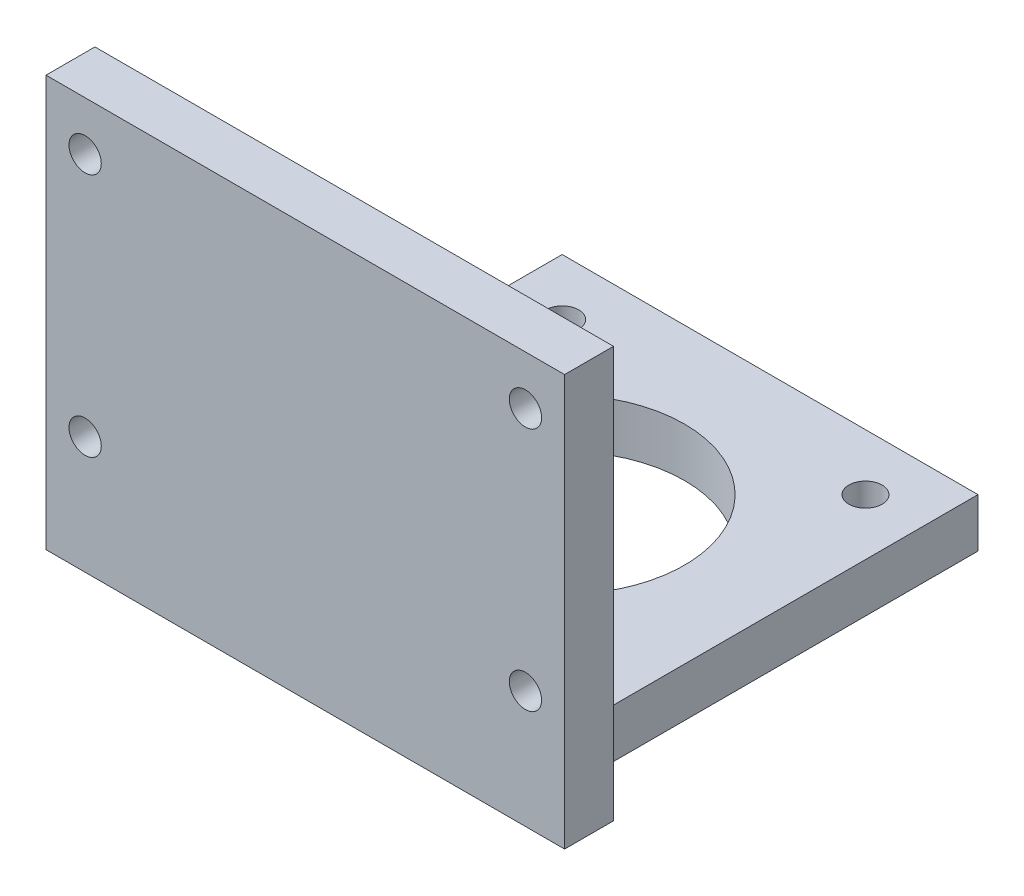
ISO-10303-21;
HEADER;
FILE_DESCRIPTION(('STEP AP214'),'2;1');
FILE_NAME('part.step','',(''),(''),'','','');
FILE_SCHEMA(('AUTOMOTIVE_DESIGN { 1 0 10303 214 1 1 1 1 }'));
ENDSEC;
DATA;
#1=APPLICATION_CONTEXT('core data for automotive mechanical design processes');
#2=APPLICATION_PROTOCOL_DEFINITION('international standard','automotive_design',2000,#1);
#3=PRODUCT_CONTEXT('',#1,'mechanical');
#4=PRODUCT('Part','Part','',(#3));
#5=PRODUCT_RELATED_PRODUCT_CATEGORY('part','',(#4));
#6=PRODUCT_DEFINITION_FORMATION('','',#4);
#7=PRODUCT_DEFINITION_CONTEXT('part definition',#1,'design');
#8=PRODUCT_DEFINITION('design','',#6,#7);
#9=PRODUCT_DEFINITION_SHAPE('','',#8);
#10=(LENGTH_UNIT() NAMED_UNIT(*) SI_UNIT(.MILLI.,.METRE.));
#11=(NAMED_UNIT(*) PLANE_ANGLE_UNIT() SI_UNIT($,.RADIAN.));
#12=(NAMED_UNIT(*) SI_UNIT($,.STERADIAN.) SOLID_ANGLE_UNIT());
#13=UNCERTAINTY_MEASURE_WITH_UNIT(LENGTH_MEASURE(1.E-05),#10,'distance_accuracy_value','');
#14=(GEOMETRIC_REPRESENTATION_CONTEXT(3) GLOBAL_UNCERTAINTY_ASSIGNED_CONTEXT((#13)) GLOBAL_UNIT_ASSIGNED_CONTEXT((#10,
#11,#12)) REPRESENTATION_CONTEXT('',''));
#15=CARTESIAN_POINT('',(0.,0.,0.));
#16=DIRECTION('',(0.,0.,1.));
#17=DIRECTION('',(1.,0.,0.));
#18=AXIS2_PLACEMENT_3D('',#15,#16,#17);
#19=CARTESIAN_POINT('',(0.,5.,0.));
#20=DIRECTION('',(0.,1.,0.));
#21=DIRECTION('',(0.,0.,1.));
#22=AXIS2_PLACEMENT_3D('',#19,#20,#21);
#23=PLANE('',#22);
#24=CARTESIAN_POINT('',(15.5,5.,15.5));
#25=DIRECTION('',(0.,1.,0.));
#26=DIRECTION('',(0.,0.,1.));
#27=AXIS2_PLACEMENT_3D('',#24,#25,#26);
#28=CIRCLE('',#27,1.7);
#29=CARTESIAN_POINT('',(15.5,5.,17.2));
#30=VERTEX_POINT('',#29);
#31=EDGE_CURVE('E143',#30,#30,#28,.T.);
#32=ORIENTED_EDGE('',*,*,#31,.F.);
#33=EDGE_LOOP('',(#32));
#34=FACE_BOUND('',#33,.T.);
#35=CARTESIAN_POINT('',(15.5,5.,-15.5));
#36=DIRECTION('',(0.,1.,0.));
#37=DIRECTION('',(0.,0.,1.));
#38=AXIS2_PLACEMENT_3D('',#35,#36,#37);
#39=CIRCLE('',#38,1.7);
#40=CARTESIAN_POINT('',(15.5,5.,-13.8));
#41=VERTEX_POINT('',#40);
#42=EDGE_CURVE('E155',#41,#41,#39,.T.);
#43=ORIENTED_EDGE('',*,*,#42,.F.);
#44=EDGE_LOOP('',(#43));
#45=FACE_BOUND('',#44,.T.);
#46=DIRECTION('',(0.,0.,-1.));
#47=VECTOR('',#46,1.);
#48=CARTESIAN_POINT('',(21.25,5.,-21.25));
#49=LINE('',#48,#47);
#50=CARTESIAN_POINT('',(21.25,5.,21.25));
#51=VERTEX_POINT('',#50);
#52=CARTESIAN_POINT('',(21.25,5.,-21.25));
#53=VERTEX_POINT('',#52);
#54=EDGE_CURVE('E167',#51,#53,#49,.T.);
#55=ORIENTED_EDGE('',*,*,#54,.T.);
#56=DIRECTION('',(-1.,0.,0.));
#57=VECTOR('',#56,1.);
#58=CARTESIAN_POINT('',(-21.25,5.,-21.25));
#59=LINE('',#58,#57);
#60=CARTESIAN_POINT('',(-21.25,5.,-21.25));
#61=VERTEX_POINT('',#60);
#62=EDGE_CURVE('E75',#53,#61,#59,.T.);
#63=ORIENTED_EDGE('',*,*,#62,.T.);
#64=DIRECTION('',(0.,0.,1.));
#65=VECTOR('',#64,1.);
#66=CARTESIAN_POINT('',(-21.25,5.,-21.25));
#67=LINE('',#66,#65);
#68=CARTESIAN_POINT('',(-21.25,5.,21.25));
#69=VERTEX_POINT('',#68);
#70=EDGE_CURVE('E171',#61,#69,#67,.T.);
#71=ORIENTED_EDGE('',*,*,#70,.T.);
#72=DIRECTION('',(1.,0.,0.));
#73=VECTOR('',#72,1.);
#74=CARTESIAN_POINT('',(-21.25,5.,21.25));
#75=LINE('',#74,#73);
#76=EDGE_CURVE('E50',#69,#51,#75,.T.);
#77=ORIENTED_EDGE('',*,*,#76,.T.);
#78=EDGE_LOOP('',(#55,#63,#71,#77));
#79=FACE_BOUND('',#78,.T.);
#80=CARTESIAN_POINT('',(-15.5,5.,-15.5));
#81=DIRECTION('',(0.,1.,0.));
#82=DIRECTION('',(0.,0.,1.));
#83=AXIS2_PLACEMENT_3D('',#80,#81,#82);
#84=CIRCLE('',#83,1.7);
#85=CARTESIAN_POINT('',(-15.5,5.,-13.8));
#86=VERTEX_POINT('',#85);
#87=EDGE_CURVE('E161',#86,#86,#84,.T.);
#88=ORIENTED_EDGE('',*,*,#87,.F.);
#89=EDGE_LOOP('',(#88));
#90=FACE_BOUND('',#89,.T.);
#91=CARTESIAN_POINT('',(-15.5,5.,15.5));
#92=DIRECTION('',(0.,1.,0.));
#93=DIRECTION('',(0.,0.,1.));
#94=AXIS2_PLACEMENT_3D('',#91,#92,#93);
#95=CIRCLE('',#94,1.7);
#96=CARTESIAN_POINT('',(-15.5,5.,17.2));
#97=VERTEX_POINT('',#96);
#98=EDGE_CURVE('E149',#97,#97,#95,.T.);
#99=ORIENTED_EDGE('',*,*,#98,.F.);
#100=EDGE_LOOP('',(#99));
#101=FACE_BOUND('',#100,.T.);
#102=CARTESIAN_POINT('',(0.,5.,0.));
#103=DIRECTION('',(0.,1.,0.));
#104=DIRECTION('',(0.,0.,1.));
#105=AXIS2_PLACEMENT_3D('',#102,#103,#104);
#106=CIRCLE('',#105,12.5);
#107=CARTESIAN_POINT('',(0.,5.,12.5));
#108=VERTEX_POINT('',#107);
#109=EDGE_CURVE('E134',#108,#108,#106,.T.);
#110=ORIENTED_EDGE('',*,*,#109,.F.);
#111=EDGE_LOOP('',(#110));
#112=FACE_BOUND('',#111,.T.);
#113=ADVANCED_FACE('F33',(#34,#45,#79,#90,#101,#112),#23,.T.);
#114=CARTESIAN_POINT('',(0.,0.,0.));
#115=DIRECTION('',(0.,1.,0.));
#116=DIRECTION('',(0.,0.,1.));
#117=AXIS2_PLACEMENT_3D('',#114,#115,#116);
#118=PLANE('',#117);
#119=DIRECTION('',(0.,0.,-1.));
#120=VECTOR('',#119,1.);
#121=CARTESIAN_POINT('',(21.25,0.,-21.25));
#122=LINE('',#121,#120);
#123=CARTESIAN_POINT('',(21.25,0.,21.25));
#124=VERTEX_POINT('',#123);
#125=CARTESIAN_POINT('',(21.25,0.,-21.25));
#126=VERTEX_POINT('',#125);
#127=EDGE_CURVE('E164',#124,#126,#122,.T.);
#128=ORIENTED_EDGE('',*,*,#127,.F.);
#129=DIRECTION('',(-1.,0.,0.));
#130=VECTOR('',#129,1.);
#131=CARTESIAN_POINT('',(-26.5,0.,21.25));
#132=LINE('',#131,#130);
#133=CARTESIAN_POINT('',(26.5,0.,21.25));
#134=VERTEX_POINT('',#133);
#135=EDGE_CURVE('E193',#134,#124,#132,.T.);
#136=ORIENTED_EDGE('',*,*,#135,.F.);
#137=DIRECTION('',(0.,0.,-1.));
#138=VECTOR('',#137,1.);
#139=CARTESIAN_POINT('',(26.5,0.,21.25));
#140=LINE('',#139,#138);
#141=CARTESIAN_POINT('',(26.5,0.,26.25));
#142=VERTEX_POINT('',#141);
#143=EDGE_CURVE('E130',#142,#134,#140,.T.);
#144=ORIENTED_EDGE('',*,*,#143,.F.);
#145=DIRECTION('',(1.,0.,0.));
#146=VECTOR('',#145,1.);
#147=CARTESIAN_POINT('',(-26.5,0.,26.25));
#148=LINE('',#147,#146);
#149=CARTESIAN_POINT('',(-26.5,0.,26.25));
#150=VERTEX_POINT('',#149);
#151=EDGE_CURVE('E126',#150,#142,#148,.T.);
#152=ORIENTED_EDGE('',*,*,#151,.F.);
#153=DIRECTION('',(0.,0.,1.));
#154=VECTOR('',#153,1.);
#155=CARTESIAN_POINT('',(-26.5,0.,21.25));
#156=LINE('',#155,#154);
#157=CARTESIAN_POINT('',(-26.5,0.,21.25));
#158=VERTEX_POINT('',#157);
#159=EDGE_CURVE('E192',#158,#150,#156,.T.);
#160=ORIENTED_EDGE('',*,*,#159,.F.);
#161=CARTESIAN_POINT('',(-21.25,0.,21.25));
#162=VERTEX_POINT('',#161);
#163=EDGE_CURVE('E190',#162,#158,#132,.T.);
#164=ORIENTED_EDGE('',*,*,#163,.F.);
#165=DIRECTION('',(0.,0.,1.));
#166=VECTOR('',#165,1.);
#167=CARTESIAN_POINT('',(-21.25,0.,-21.25));
#168=LINE('',#167,#166);
#169=CARTESIAN_POINT('',(-21.25,0.,-21.25));
#170=VERTEX_POINT('',#169);
#171=EDGE_CURVE('E169',#170,#162,#168,.T.);
#172=ORIENTED_EDGE('',*,*,#171,.F.);
#173=DIRECTION('',(-1.,0.,0.));
#174=VECTOR('',#173,1.);
#175=CARTESIAN_POINT('',(-21.25,0.,-21.25));
#176=LINE('',#175,#174);
#177=EDGE_CURVE('E63',#126,#170,#176,.T.);
#178=ORIENTED_EDGE('',*,*,#177,.F.);
#179=EDGE_LOOP('',(#128,#136,#144,#152,#160,#164,#172,#178));
#180=FACE_BOUND('',#179,.T.);
#181=CARTESIAN_POINT('',(-15.5,0.,-15.5));
#182=DIRECTION('',(0.,1.,0.));
#183=DIRECTION('',(0.,0.,1.));
#184=AXIS2_PLACEMENT_3D('',#181,#182,#183);
#185=CIRCLE('',#184,1.7);
#186=CARTESIAN_POINT('',(-15.5,0.,-13.8));
#187=VERTEX_POINT('',#186);
#188=EDGE_CURVE('E158',#187,#187,#185,.T.);
#189=ORIENTED_EDGE('',*,*,#188,.T.);
#190=EDGE_LOOP('',(#189));
#191=FACE_BOUND('',#190,.T.);
#192=CARTESIAN_POINT('',(15.5,0.,-15.5));
#193=DIRECTION('',(0.,1.,0.));
#194=DIRECTION('',(0.,0.,1.));
#195=AXIS2_PLACEMENT_3D('',#192,#193,#194);
#196=CIRCLE('',#195,1.7);
#197=CARTESIAN_POINT('',(15.5,0.,-13.8));
#198=VERTEX_POINT('',#197);
#199=EDGE_CURVE('E152',#198,#198,#196,.T.);
#200=ORIENTED_EDGE('',*,*,#199,.T.);
#201=EDGE_LOOP('',(#200));
#202=FACE_BOUND('',#201,.T.);
#203=CARTESIAN_POINT('',(-15.5,0.,15.5));
#204=DIRECTION('',(0.,1.,0.));
#205=DIRECTION('',(0.,0.,1.));
#206=AXIS2_PLACEMENT_3D('',#203,#204,#205);
#207=CIRCLE('',#206,1.7);
#208=CARTESIAN_POINT('',(-15.5,0.,17.2));
#209=VERTEX_POINT('',#208);
#210=EDGE_CURVE('E146',#209,#209,#207,.T.);
#211=ORIENTED_EDGE('',*,*,#210,.T.);
#212=EDGE_LOOP('',(#211));
#213=FACE_BOUND('',#212,.T.);
#214=CARTESIAN_POINT('',(15.5,0.,15.5));
#215=DIRECTION('',(0.,1.,0.));
#216=DIRECTION('',(0.,0.,1.));
#217=AXIS2_PLACEMENT_3D('',#214,#215,#216);
#218=CIRCLE('',#217,1.7);
#219=CARTESIAN_POINT('',(15.5,0.,17.2));
#220=VERTEX_POINT('',#219);
#221=EDGE_CURVE('E141',#220,#220,#218,.T.);
#222=ORIENTED_EDGE('',*,*,#221,.T.);
#223=EDGE_LOOP('',(#222));
#224=FACE_BOUND('',#223,.T.);
#225=CARTESIAN_POINT('',(0.,0.,0.));
#226=DIRECTION('',(0.,1.,0.));
#227=DIRECTION('',(0.,0.,1.));
#228=AXIS2_PLACEMENT_3D('',#225,#226,#227);
#229=CIRCLE('',#228,12.5);
#230=CARTESIAN_POINT('',(0.,0.,12.5));
#231=VERTEX_POINT('',#230);
#232=EDGE_CURVE('E131',#231,#231,#229,.T.);
#233=ORIENTED_EDGE('',*,*,#232,.T.);
#234=EDGE_LOOP('',(#233));
#235=FACE_BOUND('',#234,.T.);
#236=ADVANCED_FACE('F187',(#180,#191,#202,#213,#224,#235),#118,.F.);
#237=CARTESIAN_POINT('',(21.25,5.,-21.25));
#238=DIRECTION('',(-1.,0.,0.));
#239=DIRECTION('',(0.,0.,1.));
#240=AXIS2_PLACEMENT_3D('',#237,#238,#239);
#241=PLANE('',#240);
#242=ORIENTED_EDGE('',*,*,#127,.T.);
#243=DIRECTION('',(0.,-1.,0.));
#244=VECTOR('',#243,1.);
#245=CARTESIAN_POINT('',(21.25,5.,-21.25));
#246=LINE('',#245,#244);
#247=EDGE_CURVE('E11',#53,#126,#246,.T.);
#248=ORIENTED_EDGE('',*,*,#247,.F.);
#249=ORIENTED_EDGE('',*,*,#54,.F.);
#250=DIRECTION('',(0.,-1.,0.));
#251=VECTOR('',#250,1.);
#252=CARTESIAN_POINT('',(21.25,5.,21.25));
#253=LINE('',#252,#251);
#254=EDGE_CURVE('E70',#51,#124,#253,.T.);
#255=ORIENTED_EDGE('',*,*,#254,.T.);
#256=EDGE_LOOP('',(#242,#248,#249,#255));
#257=FACE_BOUND('',#256,.T.);
#258=ADVANCED_FACE('F35',(#257),#241,.F.);
#259=CARTESIAN_POINT('',(-21.25,5.,-21.25));
#260=DIRECTION('',(0.,0.,1.));
#261=DIRECTION('',(1.,0.,0.));
#262=AXIS2_PLACEMENT_3D('',#259,#260,#261);
#263=PLANE('',#262);
#264=ORIENTED_EDGE('',*,*,#177,.T.);
#265=DIRECTION('',(0.,-1.,0.));
#266=VECTOR('',#265,1.);
#267=CARTESIAN_POINT('',(-21.25,5.,-21.25));
#268=LINE('',#267,#266);
#269=EDGE_CURVE('E42',#61,#170,#268,.T.);
#270=ORIENTED_EDGE('',*,*,#269,.F.);
#271=ORIENTED_EDGE('',*,*,#62,.F.);
#272=ORIENTED_EDGE('',*,*,#247,.T.);
#273=EDGE_LOOP('',(#264,#270,#271,#272));
#274=FACE_BOUND('',#273,.T.);
#275=ADVANCED_FACE('F208',(#274),#263,.F.);
#276=CARTESIAN_POINT('',(-21.25,5.,-21.25));
#277=DIRECTION('',(1.,0.,0.));
#278=DIRECTION('',(0.,0.,-1.));
#279=AXIS2_PLACEMENT_3D('',#276,#277,#278);
#280=PLANE('',#279);
#281=ORIENTED_EDGE('',*,*,#171,.T.);
#282=DIRECTION('',(0.,-1.,0.));
#283=VECTOR('',#282,1.);
#284=CARTESIAN_POINT('',(-21.25,5.,21.25));
#285=LINE('',#284,#283);
#286=EDGE_CURVE('E178',#69,#162,#285,.T.);
#287=ORIENTED_EDGE('',*,*,#286,.F.);
#288=ORIENTED_EDGE('',*,*,#70,.F.);
#289=ORIENTED_EDGE('',*,*,#269,.T.);
#290=EDGE_LOOP('',(#281,#287,#288,#289));
#291=FACE_BOUND('',#290,.T.);
#292=ADVANCED_FACE('F183',(#291),#280,.F.);
#293=CARTESIAN_POINT('',(-15.5,5.,-15.5));
#294=DIRECTION('',(0.,-1.,0.));
#295=DIRECTION('',(0.,0.,-1.));
#296=AXIS2_PLACEMENT_3D('',#293,#294,#295);
#297=CYLINDRICAL_SURFACE('',#296,1.7);
#298=ORIENTED_EDGE('',*,*,#87,.T.);
#299=EDGE_LOOP('',(#298));
#300=FACE_BOUND('',#299,.T.);
#301=ORIENTED_EDGE('',*,*,#188,.F.);
#302=EDGE_LOOP('',(#301));
#303=FACE_BOUND('',#302,.T.);
#304=ADVANCED_FACE('F214',(#300,#303),#297,.F.);
#305=CARTESIAN_POINT('',(15.5,5.,-15.5));
#306=DIRECTION('',(0.,-1.,0.));
#307=DIRECTION('',(0.,0.,-1.));
#308=AXIS2_PLACEMENT_3D('',#305,#306,#307);
#309=CYLINDRICAL_SURFACE('',#308,1.7);
#310=ORIENTED_EDGE('',*,*,#42,.T.);
#311=EDGE_LOOP('',(#310));
#312=FACE_BOUND('',#311,.T.);
#313=ORIENTED_EDGE('',*,*,#199,.F.);
#314=EDGE_LOOP('',(#313));
#315=FACE_BOUND('',#314,.T.);
#316=ADVANCED_FACE('F228',(#312,#315),#309,.F.);
#317=CARTESIAN_POINT('',(-15.5,5.,15.5));
#318=DIRECTION('',(0.,-1.,0.));
#319=DIRECTION('',(0.,0.,-1.));
#320=AXIS2_PLACEMENT_3D('',#317,#318,#319);
#321=CYLINDRICAL_SURFACE('',#320,1.7);
#322=ORIENTED_EDGE('',*,*,#98,.T.);
#323=EDGE_LOOP('',(#322));
#324=FACE_BOUND('',#323,.T.);
#325=ORIENTED_EDGE('',*,*,#210,.F.);
#326=EDGE_LOOP('',(#325));
#327=FACE_BOUND('',#326,.T.);
#328=ADVANCED_FACE('F232',(#324,#327),#321,.F.);
#329=CARTESIAN_POINT('',(15.5,5.,15.5));
#330=DIRECTION('',(0.,-1.,0.));
#331=DIRECTION('',(0.,0.,-1.));
#332=AXIS2_PLACEMENT_3D('',#329,#330,#331);
#333=CYLINDRICAL_SURFACE('',#332,1.7);
#334=ORIENTED_EDGE('',*,*,#31,.T.);
#335=EDGE_LOOP('',(#334));
#336=FACE_BOUND('',#335,.T.);
#337=ORIENTED_EDGE('',*,*,#221,.F.);
#338=EDGE_LOOP('',(#337));
#339=FACE_BOUND('',#338,.T.);
#340=ADVANCED_FACE('F236',(#336,#339),#333,.F.);
#341=CARTESIAN_POINT('',(0.,5.,0.));
#342=DIRECTION('',(0.,-1.,0.));
#343=DIRECTION('',(0.,0.,-1.));
#344=AXIS2_PLACEMENT_3D('',#341,#342,#343);
#345=CYLINDRICAL_SURFACE('',#344,12.5);
#346=ORIENTED_EDGE('',*,*,#109,.T.);
#347=EDGE_LOOP('',(#346));
#348=FACE_BOUND('',#347,.T.);
#349=ORIENTED_EDGE('',*,*,#232,.F.);
#350=EDGE_LOOP('',(#349));
#351=FACE_BOUND('',#350,.T.);
#352=ADVANCED_FACE('F240',(#348,#351),#345,.F.);
#353=CARTESIAN_POINT('',(26.5,42.,21.25));
#354=DIRECTION('',(-1.,0.,0.));
#355=DIRECTION('',(0.,0.,1.));
#356=AXIS2_PLACEMENT_3D('',#353,#354,#355);
#357=PLANE('',#356);
#358=ORIENTED_EDGE('',*,*,#143,.T.);
#359=DIRECTION('',(0.,-1.,0.));
#360=VECTOR('',#359,1.);
#361=CARTESIAN_POINT('',(26.5,42.,21.25));
#362=LINE('',#361,#360);
#363=CARTESIAN_POINT('',(26.5,42.,21.25));
#364=VERTEX_POINT('',#363);
#365=EDGE_CURVE('E110',#364,#134,#362,.T.);
#366=ORIENTED_EDGE('',*,*,#365,.F.);
#367=DIRECTION('',(0.,0.,-1.));
#368=VECTOR('',#367,1.);
#369=CARTESIAN_POINT('',(26.5,42.,21.25));
#370=LINE('',#369,#368);
#371=CARTESIAN_POINT('',(26.5,42.,26.25));
#372=VERTEX_POINT('',#371);
#373=EDGE_CURVE('E117',#372,#364,#370,.T.);
#374=ORIENTED_EDGE('',*,*,#373,.F.);
#375=DIRECTION('',(0.,-1.,0.));
#376=VECTOR('',#375,1.);
#377=CARTESIAN_POINT('',(26.5,42.,26.25));
#378=LINE('',#377,#376);
#379=EDGE_CURVE('E201',#372,#142,#378,.T.);
#380=ORIENTED_EDGE('',*,*,#379,.T.);
#381=EDGE_LOOP('',(#358,#366,#374,#380));
#382=FACE_BOUND('',#381,.T.);
#383=ADVANCED_FACE('F128',(#382),#357,.F.);
#384=CARTESIAN_POINT('',(-26.5,42.,21.25));
#385=DIRECTION('',(0.,0.,1.));
#386=DIRECTION('',(1.,0.,0.));
#387=AXIS2_PLACEMENT_3D('',#384,#385,#386);
#388=PLANE('',#387);
#389=CARTESIAN_POINT('',(22.5,12.,21.25));
#390=DIRECTION('',(0.,0.,1.));
#391=DIRECTION('',(1.,0.,0.));
#392=AXIS2_PLACEMENT_3D('',#389,#390,#391);
#393=CIRCLE('',#392,1.65);
#394=CARTESIAN_POINT('',(24.15,12.,21.25));
#395=VERTEX_POINT('',#394);
#396=EDGE_CURVE('E281',#395,#395,#393,.T.);
#397=ORIENTED_EDGE('',*,*,#396,.T.);
#398=EDGE_LOOP('',(#397));
#399=FACE_BOUND('',#398,.T.);
#400=CARTESIAN_POINT('',(-22.5,37.,21.25));
#401=DIRECTION('',(0.,0.,1.));
#402=DIRECTION('',(1.,0.,0.));
#403=AXIS2_PLACEMENT_3D('',#400,#401,#402);
#404=CIRCLE('',#403,1.65);
#405=CARTESIAN_POINT('',(-20.85,37.,21.25));
#406=VERTEX_POINT('',#405);
#407=EDGE_CURVE('E283',#406,#406,#404,.T.);
#408=ORIENTED_EDGE('',*,*,#407,.T.);
#409=EDGE_LOOP('',(#408));
#410=FACE_BOUND('',#409,.T.);
#411=CARTESIAN_POINT('',(-22.5,12.,21.25));
#412=DIRECTION('',(0.,0.,1.));
#413=DIRECTION('',(1.,0.,0.));
#414=AXIS2_PLACEMENT_3D('',#411,#412,#413);
#415=CIRCLE('',#414,1.65);
#416=CARTESIAN_POINT('',(-20.85,12.,21.25));
#417=VERTEX_POINT('',#416);
#418=EDGE_CURVE('E288',#417,#417,#415,.T.);
#419=ORIENTED_EDGE('',*,*,#418,.T.);
#420=EDGE_LOOP('',(#419));
#421=FACE_BOUND('',#420,.T.);
#422=CARTESIAN_POINT('',(22.5,37.,21.25));
#423=DIRECTION('',(0.,0.,1.));
#424=DIRECTION('',(1.,0.,0.));
#425=AXIS2_PLACEMENT_3D('',#422,#423,#424);
#426=CIRCLE('',#425,1.65);
#427=CARTESIAN_POINT('',(24.15,37.,21.25));
#428=VERTEX_POINT('',#427);
#429=EDGE_CURVE('E195',#428,#428,#426,.T.);
#430=ORIENTED_EDGE('',*,*,#429,.T.);
#431=EDGE_LOOP('',(#430));
#432=FACE_BOUND('',#431,.T.);
#433=ORIENTED_EDGE('',*,*,#254,.F.);
#434=ORIENTED_EDGE('',*,*,#76,.F.);
#435=ORIENTED_EDGE('',*,*,#286,.T.);
#436=ORIENTED_EDGE('',*,*,#163,.T.);
#437=DIRECTION('',(0.,-1.,0.));
#438=VECTOR('',#437,1.);
#439=CARTESIAN_POINT('',(-26.5,42.,21.25));
#440=LINE('',#439,#438);
#441=CARTESIAN_POINT('',(-26.5,42.,21.25));
#442=VERTEX_POINT('',#441);
#443=EDGE_CURVE('E113',#442,#158,#440,.T.);
#444=ORIENTED_EDGE('',*,*,#443,.F.);
#445=DIRECTION('',(-1.,0.,0.));
#446=VECTOR('',#445,1.);
#447=CARTESIAN_POINT('',(-26.5,42.,21.25));
#448=LINE('',#447,#446);
#449=EDGE_CURVE('E105',#364,#442,#448,.T.);
#450=ORIENTED_EDGE('',*,*,#449,.F.);
#451=ORIENTED_EDGE('',*,*,#365,.T.);
#452=ORIENTED_EDGE('',*,*,#135,.T.);
#453=EDGE_LOOP('',(#433,#434,#435,#436,#444,#450,#451,#452));
#454=FACE_BOUND('',#453,.T.);
#455=ADVANCED_FACE('F107',(#399,#410,#421,#432,#454),#388,.F.);
#456=CARTESIAN_POINT('',(-26.5,42.,21.25));
#457=DIRECTION('',(1.,0.,0.));
#458=DIRECTION('',(0.,0.,-1.));
#459=AXIS2_PLACEMENT_3D('',#456,#457,#458);
#460=PLANE('',#459);
#461=ORIENTED_EDGE('',*,*,#159,.T.);
#462=DIRECTION('',(0.,-1.,0.));
#463=VECTOR('',#462,1.);
#464=CARTESIAN_POINT('',(-26.5,42.,26.25));
#465=LINE('',#464,#463);
#466=CARTESIAN_POINT('',(-26.5,42.,26.25));
#467=VERTEX_POINT('',#466);
#468=EDGE_CURVE('E136',#467,#150,#465,.T.);
#469=ORIENTED_EDGE('',*,*,#468,.F.);
#470=DIRECTION('',(0.,0.,1.));
#471=VECTOR('',#470,1.);
#472=CARTESIAN_POINT('',(-26.5,42.,21.25));
#473=LINE('',#472,#471);
#474=EDGE_CURVE('E116',#442,#467,#473,.T.);
#475=ORIENTED_EDGE('',*,*,#474,.F.);
#476=ORIENTED_EDGE('',*,*,#443,.T.);
#477=EDGE_LOOP('',(#461,#469,#475,#476));
#478=FACE_BOUND('',#477,.T.);
#479=ADVANCED_FACE('F249',(#478),#460,.F.);
#480=CARTESIAN_POINT('',(-26.5,42.,26.25));
#481=DIRECTION('',(0.,0.,-1.));
#482=DIRECTION('',(-1.,0.,0.));
#483=AXIS2_PLACEMENT_3D('',#480,#481,#482);
#484=PLANE('',#483);
#485=CARTESIAN_POINT('',(22.5,12.,26.25));
#486=DIRECTION('',(0.,0.,1.));
#487=DIRECTION('',(1.,0.,0.));
#488=AXIS2_PLACEMENT_3D('',#485,#486,#487);
#489=CIRCLE('',#488,1.65);
#490=CARTESIAN_POINT('',(24.15,12.,26.25));
#491=VERTEX_POINT('',#490);
#492=EDGE_CURVE('E278',#491,#491,#489,.T.);
#493=ORIENTED_EDGE('',*,*,#492,.F.);
#494=EDGE_LOOP('',(#493));
#495=FACE_BOUND('',#494,.T.);
#496=CARTESIAN_POINT('',(-22.5,37.,26.25));
#497=DIRECTION('',(0.,0.,1.));
#498=DIRECTION('',(1.,0.,0.));
#499=AXIS2_PLACEMENT_3D('',#496,#497,#498);
#500=CIRCLE('',#499,1.65);
#501=CARTESIAN_POINT('',(-20.85,37.,26.25));
#502=VERTEX_POINT('',#501);
#503=EDGE_CURVE('E302',#502,#502,#500,.T.);
#504=ORIENTED_EDGE('',*,*,#503,.F.);
#505=EDGE_LOOP('',(#504));
#506=FACE_BOUND('',#505,.T.);
#507=CARTESIAN_POINT('',(-22.5,12.,26.25));
#508=DIRECTION('',(0.,0.,1.));
#509=DIRECTION('',(1.,0.,0.));
#510=AXIS2_PLACEMENT_3D('',#507,#508,#509);
#511=CIRCLE('',#510,1.65);
#512=CARTESIAN_POINT('',(-20.85,12.,26.25));
#513=VERTEX_POINT('',#512);
#514=EDGE_CURVE('E299',#513,#513,#511,.T.);
#515=ORIENTED_EDGE('',*,*,#514,.F.);
#516=EDGE_LOOP('',(#515));
#517=FACE_BOUND('',#516,.T.);
#518=CARTESIAN_POINT('',(22.5,37.,26.25));
#519=DIRECTION('',(0.,0.,1.));
#520=DIRECTION('',(1.,0.,0.));
#521=AXIS2_PLACEMENT_3D('',#518,#519,#520);
#522=CIRCLE('',#521,1.65);
#523=CARTESIAN_POINT('',(24.15,37.,26.25));
#524=VERTEX_POINT('',#523);
#525=EDGE_CURVE('E282',#524,#524,#522,.T.);
#526=ORIENTED_EDGE('',*,*,#525,.F.);
#527=EDGE_LOOP('',(#526));
#528=FACE_BOUND('',#527,.T.);
#529=ORIENTED_EDGE('',*,*,#151,.T.);
#530=ORIENTED_EDGE('',*,*,#379,.F.);
#531=DIRECTION('',(1.,0.,0.));
#532=VECTOR('',#531,1.);
#533=CARTESIAN_POINT('',(-26.5,42.,26.25));
#534=LINE('',#533,#532);
#535=EDGE_CURVE('E122',#467,#372,#534,.T.);
#536=ORIENTED_EDGE('',*,*,#535,.F.);
#537=ORIENTED_EDGE('',*,*,#468,.T.);
#538=EDGE_LOOP('',(#529,#530,#536,#537));
#539=FACE_BOUND('',#538,.T.);
#540=ADVANCED_FACE('F205',(#495,#506,#517,#528,#539),#484,.F.);
#541=CARTESIAN_POINT('',(0.,42.,0.));
#542=DIRECTION('',(0.,1.,0.));
#543=DIRECTION('',(0.,0.,1.));
#544=AXIS2_PLACEMENT_3D('',#541,#542,#543);
#545=PLANE('',#544);
#546=ORIENTED_EDGE('',*,*,#373,.T.);
#547=ORIENTED_EDGE('',*,*,#449,.T.);
#548=ORIENTED_EDGE('',*,*,#474,.T.);
#549=ORIENTED_EDGE('',*,*,#535,.T.);
#550=EDGE_LOOP('',(#546,#547,#548,#549));
#551=FACE_BOUND('',#550,.T.);
#552=ADVANCED_FACE('F120',(#551),#545,.T.);
#553=CARTESIAN_POINT('',(22.5,37.,-15.75));
#554=DIRECTION('',(0.,0.,1.));
#555=DIRECTION('',(1.,0.,0.));
#556=AXIS2_PLACEMENT_3D('',#553,#554,#555);
#557=CYLINDRICAL_SURFACE('',#556,1.65);
#558=ORIENTED_EDGE('',*,*,#525,.T.);
#559=EDGE_LOOP('',(#558));
#560=FACE_BOUND('',#559,.T.);
#561=ORIENTED_EDGE('',*,*,#429,.F.);
#562=EDGE_LOOP('',(#561));
#563=FACE_BOUND('',#562,.T.);
#564=ADVANCED_FACE('F258',(#560,#563),#557,.F.);
#565=CARTESIAN_POINT('',(-22.5,12.,-15.75));
#566=DIRECTION('',(0.,0.,1.));
#567=DIRECTION('',(1.,0.,0.));
#568=AXIS2_PLACEMENT_3D('',#565,#566,#567);
#569=CYLINDRICAL_SURFACE('',#568,1.65);
#570=ORIENTED_EDGE('',*,*,#514,.T.);
#571=EDGE_LOOP('',(#570));
#572=FACE_BOUND('',#571,.T.);
#573=ORIENTED_EDGE('',*,*,#418,.F.);
#574=EDGE_LOOP('',(#573));
#575=FACE_BOUND('',#574,.T.);
#576=ADVANCED_FACE('F261',(#572,#575),#569,.F.);
#577=CARTESIAN_POINT('',(-22.5,37.,-15.75));
#578=DIRECTION('',(0.,0.,1.));
#579=DIRECTION('',(1.,0.,0.));
#580=AXIS2_PLACEMENT_3D('',#577,#578,#579);
#581=CYLINDRICAL_SURFACE('',#580,1.65);
#582=ORIENTED_EDGE('',*,*,#503,.T.);
#583=EDGE_LOOP('',(#582));
#584=FACE_BOUND('',#583,.T.);
#585=ORIENTED_EDGE('',*,*,#407,.F.);
#586=EDGE_LOOP('',(#585));
#587=FACE_BOUND('',#586,.T.);
#588=ADVANCED_FACE('F265',(#584,#587),#581,.F.);
#589=CARTESIAN_POINT('',(22.5,12.,-15.75));
#590=DIRECTION('',(0.,0.,1.));
#591=DIRECTION('',(1.,0.,0.));
#592=AXIS2_PLACEMENT_3D('',#589,#590,#591);
#593=CYLINDRICAL_SURFACE('',#592,1.65);
#594=ORIENTED_EDGE('',*,*,#492,.T.);
#595=EDGE_LOOP('',(#594));
#596=FACE_BOUND('',#595,.T.);
#597=ORIENTED_EDGE('',*,*,#396,.F.);
#598=EDGE_LOOP('',(#597));
#599=FACE_BOUND('',#598,.T.);
#600=ADVANCED_FACE('F269',(#596,#599),#593,.F.);
#601=CLOSED_SHELL('',(#113,#236,#258,#275,#292,#304,#316,#328,#340,#352,#383,#455,#479,#540,
#552,#564,#576,#588,#600));
#602=MANIFOLD_SOLID_BREP('B2',#601);
#603=ADVANCED_BREP_SHAPE_REPRESENTATION('',(#18,#602),#14);
#604=SHAPE_DEFINITION_REPRESENTATION(#9,#603);
ENDSEC;
END-ISO-10303-21;
